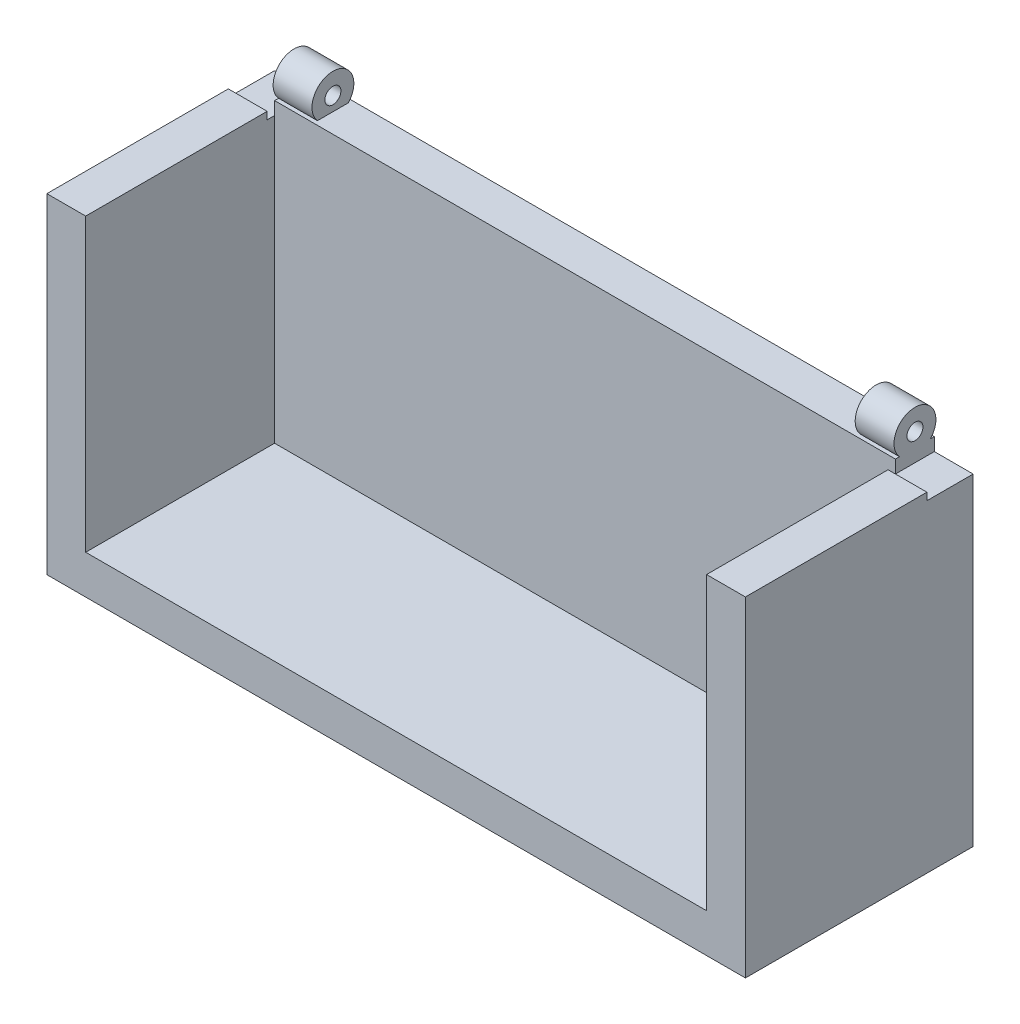
ISO-10303-21;
HEADER;
FILE_DESCRIPTION(('STEP AP214'),'2;1');
FILE_NAME('part.step','',(''),(''),'','','');
FILE_SCHEMA(('AUTOMOTIVE_DESIGN { 1 0 10303 214 1 1 1 1 }'));
ENDSEC;
DATA;
#1=APPLICATION_CONTEXT('core data for automotive mechanical design processes');
#2=APPLICATION_PROTOCOL_DEFINITION('international standard','automotive_design',2000,#1);
#3=PRODUCT_CONTEXT('',#1,'mechanical');
#4=PRODUCT('Part','Part','',(#3));
#5=PRODUCT_RELATED_PRODUCT_CATEGORY('part','',(#4));
#6=PRODUCT_DEFINITION_FORMATION('','',#4);
#7=PRODUCT_DEFINITION_CONTEXT('part definition',#1,'design');
#8=PRODUCT_DEFINITION('design','',#6,#7);
#9=PRODUCT_DEFINITION_SHAPE('','',#8);
#10=(LENGTH_UNIT() NAMED_UNIT(*) SI_UNIT(.MILLI.,.METRE.));
#11=(NAMED_UNIT(*) PLANE_ANGLE_UNIT() SI_UNIT($,.RADIAN.));
#12=(NAMED_UNIT(*) SI_UNIT($,.STERADIAN.) SOLID_ANGLE_UNIT());
#13=UNCERTAINTY_MEASURE_WITH_UNIT(LENGTH_MEASURE(1.E-05),#10,'distance_accuracy_value','');
#14=(GEOMETRIC_REPRESENTATION_CONTEXT(3) GLOBAL_UNCERTAINTY_ASSIGNED_CONTEXT((#13)) GLOBAL_UNIT_ASSIGNED_CONTEXT((#10,
#11,#12)) REPRESENTATION_CONTEXT('',''));
#15=CARTESIAN_POINT('',(0.,0.,0.));
#16=DIRECTION('',(0.,0.,1.));
#17=DIRECTION('',(1.,0.,0.));
#18=AXIS2_PLACEMENT_3D('',#15,#16,#17);
#19=CARTESIAN_POINT('',(0.,85.,0.));
#20=DIRECTION('',(0.,1.,0.));
#21=DIRECTION('',(0.,0.,1.));
#22=AXIS2_PLACEMENT_3D('',#19,#20,#21);
#23=PLANE('',#22);
#24=DIRECTION('',(0.,0.,-1.));
#25=VECTOR('',#24,1.);
#26=CARTESIAN_POINT('',(96.5915980230643,85.,4.40749588138387));
#27=LINE('',#26,#25);
#28=CARTESIAN_POINT('',(96.5915980230643,85.,-65.6823443186161));
#29=VERTEX_POINT('',#28);
#30=CARTESIAN_POINT('',(96.5915980230643,85.,-68.5425041186161));
#31=VERTEX_POINT('',#30);
#32=EDGE_CURVE('E238',#29,#31,#27,.T.);
#33=ORIENTED_EDGE('',*,*,#32,.F.);
#34=DIRECTION('',(-1.,0.,0.));
#35=VECTOR('',#34,1.);
#36=CARTESIAN_POINT('',(111.591598023064,85.,-65.6823443186161));
#37=LINE('',#36,#35);
#38=CARTESIAN_POINT('',(111.591598023064,85.,-65.6823443186161));
#39=VERTEX_POINT('',#38);
#40=EDGE_CURVE('E187',#39,#29,#37,.T.);
#41=ORIENTED_EDGE('',*,*,#40,.F.);
#42=DIRECTION('',(0.,0.,-1.));
#43=VECTOR('',#42,1.);
#44=CARTESIAN_POINT('',(111.591598023064,85.,-68.5425041186162));
#45=LINE('',#44,#43);
#46=CARTESIAN_POINT('',(111.591598023064,85.,-83.5425041186161));
#47=VERTEX_POINT('',#46);
#48=EDGE_CURVE('E268',#39,#47,#45,.T.);
#49=ORIENTED_EDGE('',*,*,#48,.T.);
#50=DIRECTION('',(-1.,0.,0.));
#51=VECTOR('',#50,1.);
#52=CARTESIAN_POINT('',(111.591598023064,85.,-83.5425041186161));
#53=LINE('',#52,#51);
#54=CARTESIAN_POINT('',(96.5915980230643,85.,-83.5425041186161));
#55=VERTEX_POINT('',#54);
#56=EDGE_CURVE('E271',#47,#55,#53,.T.);
#57=ORIENTED_EDGE('',*,*,#56,.T.);
#58=DIRECTION('',(0.,0.,1.));
#59=VECTOR('',#58,1.);
#60=CARTESIAN_POINT('',(96.5915980230643,85.,-83.5425041186161));
#61=LINE('',#60,#59);
#62=EDGE_CURVE('E265',#55,#31,#61,.T.);
#63=ORIENTED_EDGE('',*,*,#62,.T.);
#64=EDGE_LOOP('',(#33,#41,#49,#57,#63));
#65=FACE_BOUND('',#64,.T.);
#66=ADVANCED_FACE('F33',(#65),#23,.T.);
#67=CARTESIAN_POINT('',(111.591598023064,15.,58.9574958813839));
#68=DIRECTION('',(-1.,0.,0.));
#69=DIRECTION('',(0.,0.,1.));
#70=AXIS2_PLACEMENT_3D('',#67,#68,#69);
#71=PLANE('',#70);
#72=ORIENTED_EDGE('',*,*,#48,.F.);
#73=DIRECTION('',(0.,-1.,0.));
#74=VECTOR('',#73,1.);
#75=CARTESIAN_POINT('',(111.591598023064,87.85,-65.6823443186161));
#76=LINE('',#75,#74);
#77=CARTESIAN_POINT('',(111.591598023064,87.85,-65.6823443186161));
#78=VERTEX_POINT('',#77);
#79=EDGE_CURVE('E196',#78,#39,#76,.T.);
#80=ORIENTED_EDGE('',*,*,#79,.F.);
#81=DIRECTION('',(0.,0.,-1.));
#82=VECTOR('',#81,1.);
#83=CARTESIAN_POINT('',(111.591598023064,87.85,4.40749588138387));
#84=LINE('',#83,#82);
#85=CARTESIAN_POINT('',(111.591598023064,87.85,4.40749588138387));
#86=VERTEX_POINT('',#85);
#87=EDGE_CURVE('E193',#86,#78,#84,.T.);
#88=ORIENTED_EDGE('',*,*,#87,.F.);
#89=DIRECTION('',(0.,1.,0.));
#90=VECTOR('',#89,1.);
#91=CARTESIAN_POINT('',(111.591598023064,-39.6,4.40749588138387));
#92=LINE('',#91,#90);
#93=CARTESIAN_POINT('',(111.591598023064,-39.6,4.40749588138387));
#94=VERTEX_POINT('',#93);
#95=EDGE_CURVE('E172',#94,#86,#92,.T.);
#96=ORIENTED_EDGE('',*,*,#95,.F.);
#97=DIRECTION('',(0.,0.,1.));
#98=VECTOR('',#97,1.);
#99=CARTESIAN_POINT('',(111.591598023064,-39.6,-68.5425041186162));
#100=LINE('',#99,#98);
#101=CARTESIAN_POINT('',(111.591598023064,-39.6,-83.5425041186161));
#102=VERTEX_POINT('',#101);
#103=EDGE_CURVE('E247',#102,#94,#100,.T.);
#104=ORIENTED_EDGE('',*,*,#103,.F.);
#105=DIRECTION('',(0.,-1.,0.));
#106=VECTOR('',#105,1.);
#107=CARTESIAN_POINT('',(111.591598023064,15.,-83.5425041186161));
#108=LINE('',#107,#106);
#109=EDGE_CURVE('E311',#47,#102,#108,.T.);
#110=ORIENTED_EDGE('',*,*,#109,.F.);
#111=EDGE_LOOP('',(#72,#80,#88,#96,#104,#110));
#112=FACE_BOUND('',#111,.T.);
#113=ADVANCED_FACE('F35',(#112),#71,.F.);
#114=CARTESIAN_POINT('',(0.,90.,0.));
#115=DIRECTION('',(0.,1.,0.));
#116=DIRECTION('',(0.,0.,1.));
#117=AXIS2_PLACEMENT_3D('',#114,#115,#116);
#118=PLANE('',#117);
#119=DIRECTION('',(0.,0.,-1.));
#120=VECTOR('',#119,1.);
#121=CARTESIAN_POINT('',(-143.208401976936,90.,-83.5425041186162));
#122=LINE('',#121,#120);
#123=CARTESIAN_POINT('',(-143.208401976936,90.,-68.5425041186162));
#124=VERTEX_POINT('',#123);
#125=CARTESIAN_POINT('',(-143.208401976936,90.,-70.0970029147323));
#126=VERTEX_POINT('',#125);
#127=EDGE_CURVE('E252',#124,#126,#122,.T.);
#128=ORIENTED_EDGE('',*,*,#127,.F.);
#129=DIRECTION('',(1.,0.,0.));
#130=VECTOR('',#129,1.);
#131=CARTESIAN_POINT('',(-143.208401976936,90.,-68.5425041186162));
#132=LINE('',#131,#130);
#133=CARTESIAN_POINT('',(96.5915980230643,90.,-68.5425041186161));
#134=VERTEX_POINT('',#133);
#135=EDGE_CURVE('E301',#124,#134,#132,.T.);
#136=ORIENTED_EDGE('',*,*,#135,.T.);
#137=DIRECTION('',(0.,0.,1.));
#138=VECTOR('',#137,1.);
#139=CARTESIAN_POINT('',(96.5915980230643,90.,-83.5425041186161));
#140=LINE('',#139,#138);
#141=CARTESIAN_POINT('',(96.5915980230643,90.,-70.0970029147323));
#142=VERTEX_POINT('',#141);
#143=EDGE_CURVE('E249',#142,#134,#140,.T.);
#144=ORIENTED_EDGE('',*,*,#143,.F.);
#145=DIRECTION('',(1.,0.,0.));
#146=VECTOR('',#145,1.);
#147=CARTESIAN_POINT('',(81.5915980230643,90.,-70.0970029147323));
#148=LINE('',#147,#146);
#149=CARTESIAN_POINT('',(81.5915980230643,90.,-70.0970029147323));
#150=VERTEX_POINT('',#149);
#151=EDGE_CURVE('E41',#142,#150,#148,.F.);
#152=ORIENTED_EDGE('',*,*,#151,.T.);
#153=DIRECTION('',(0.,0.,1.));
#154=VECTOR('',#153,1.);
#155=CARTESIAN_POINT('',(81.5915980230643,90.,0.));
#156=LINE('',#155,#154);
#157=CARTESIAN_POINT('',(81.5915980230643,90.,-82.0449720805085));
#158=VERTEX_POINT('',#157);
#159=EDGE_CURVE('E11',#158,#150,#156,.T.);
#160=ORIENTED_EDGE('',*,*,#159,.F.);
#161=DIRECTION('',(1.,0.,0.));
#162=VECTOR('',#161,1.);
#163=CARTESIAN_POINT('',(81.5915980230643,90.,-82.0449720805085));
#164=LINE('',#163,#162);
#165=CARTESIAN_POINT('',(96.5915980230643,90.,-82.0449720805085));
#166=VERTEX_POINT('',#165);
#167=EDGE_CURVE('E321',#158,#166,#164,.T.);
#168=ORIENTED_EDGE('',*,*,#167,.T.);
#169=CARTESIAN_POINT('',(96.5915980230643,90.,-83.5425041186161));
#170=VERTEX_POINT('',#169);
#171=EDGE_CURVE('E269',#170,#166,#140,.T.);
#172=ORIENTED_EDGE('',*,*,#171,.F.);
#173=DIRECTION('',(-1.,0.,0.));
#174=VECTOR('',#173,1.);
#175=CARTESIAN_POINT('',(111.591598023064,90.,-83.5425041186161));
#176=LINE('',#175,#174);
#177=CARTESIAN_POINT('',(-143.208401976936,90.,-83.5425041186162));
#178=VERTEX_POINT('',#177);
#179=EDGE_CURVE('E306',#170,#178,#176,.T.);
#180=ORIENTED_EDGE('',*,*,#179,.T.);
#181=CARTESIAN_POINT('',(-143.208401976936,90.,-82.0449720805085));
#182=VERTEX_POINT('',#181);
#183=EDGE_CURVE('E259',#182,#178,#122,.T.);
#184=ORIENTED_EDGE('',*,*,#183,.F.);
#185=DIRECTION('',(-1.,0.,0.));
#186=VECTOR('',#185,1.);
#187=CARTESIAN_POINT('',(-128.208401976936,90.,-82.0449720805085));
#188=LINE('',#187,#186);
#189=CARTESIAN_POINT('',(-128.208401976936,90.,-82.0449720805085));
#190=VERTEX_POINT('',#189);
#191=EDGE_CURVE('E318',#182,#190,#188,.F.);
#192=ORIENTED_EDGE('',*,*,#191,.T.);
#193=DIRECTION('',(0.,0.,-1.));
#194=VECTOR('',#193,1.);
#195=CARTESIAN_POINT('',(-128.208401976936,90.,0.));
#196=LINE('',#195,#194);
#197=CARTESIAN_POINT('',(-128.208401976936,90.,-70.0970029147323));
#198=VERTEX_POINT('',#197);
#199=EDGE_CURVE('E316',#198,#190,#196,.T.);
#200=ORIENTED_EDGE('',*,*,#199,.F.);
#201=DIRECTION('',(-1.,0.,0.));
#202=VECTOR('',#201,1.);
#203=CARTESIAN_POINT('',(-128.208401976936,90.,-70.0970029147323));
#204=LINE('',#203,#202);
#205=EDGE_CURVE('E313',#198,#126,#204,.T.);
#206=ORIENTED_EDGE('',*,*,#205,.T.);
#207=EDGE_LOOP('',(#128,#136,#144,#152,#160,#168,#172,#180,#184,#192,#200,#206));
#208=FACE_BOUND('',#207,.T.);
#209=ADVANCED_FACE('F328',(#208),#118,.T.);
#210=CARTESIAN_POINT('',(-158.208401976936,15.,-83.5425041186162));
#211=DIRECTION('',(0.,0.,1.));
#212=DIRECTION('',(1.,0.,0.));
#213=AXIS2_PLACEMENT_3D('',#210,#211,#212);
#214=PLANE('',#213);
#215=DIRECTION('',(-1.,0.,0.));
#216=VECTOR('',#215,1.);
#217=CARTESIAN_POINT('',(-158.208401976936,85.,-83.5425041186162));
#218=LINE('',#217,#216);
#219=CARTESIAN_POINT('',(-143.208401976936,85.,-83.5425041186162));
#220=VERTEX_POINT('',#219);
#221=CARTESIAN_POINT('',(-158.208401976936,85.,-83.5425041186162));
#222=VERTEX_POINT('',#221);
#223=EDGE_CURVE('E255',#220,#222,#218,.T.);
#224=ORIENTED_EDGE('',*,*,#223,.F.);
#225=DIRECTION('',(0.,1.,0.));
#226=VECTOR('',#225,1.);
#227=CARTESIAN_POINT('',(-143.208401976936,85.,-83.5425041186162));
#228=LINE('',#227,#226);
#229=EDGE_CURVE('E260',#220,#178,#228,.T.);
#230=ORIENTED_EDGE('',*,*,#229,.T.);
#231=ORIENTED_EDGE('',*,*,#179,.F.);
#232=DIRECTION('',(0.,1.,0.));
#233=VECTOR('',#232,1.);
#234=CARTESIAN_POINT('',(96.5915980230643,85.,-83.5425041186161));
#235=LINE('',#234,#233);
#236=EDGE_CURVE('E276',#55,#170,#235,.T.);
#237=ORIENTED_EDGE('',*,*,#236,.F.);
#238=ORIENTED_EDGE('',*,*,#56,.F.);
#239=ORIENTED_EDGE('',*,*,#109,.T.);
#240=DIRECTION('',(1.,0.,0.));
#241=VECTOR('',#240,1.);
#242=CARTESIAN_POINT('',(111.591598023064,-39.6,-83.5425041186161));
#243=LINE('',#242,#241);
#244=CARTESIAN_POINT('',(-158.208401976936,-39.6,-83.5425041186162));
#245=VERTEX_POINT('',#244);
#246=EDGE_CURVE('E244',#245,#102,#243,.T.);
#247=ORIENTED_EDGE('',*,*,#246,.F.);
#248=DIRECTION('',(0.,-1.,0.));
#249=VECTOR('',#248,1.);
#250=CARTESIAN_POINT('',(-158.208401976936,15.,-83.5425041186162));
#251=LINE('',#250,#249);
#252=EDGE_CURVE('E309',#222,#245,#251,.T.);
#253=ORIENTED_EDGE('',*,*,#252,.F.);
#254=EDGE_LOOP('',(#224,#230,#231,#237,#238,#239,#247,#253));
#255=FACE_BOUND('',#254,.T.);
#256=ADVANCED_FACE('F447',(#255),#214,.F.);
#257=CARTESIAN_POINT('',(-158.208401976936,15.,58.9574958813839));
#258=DIRECTION('',(1.,0.,0.));
#259=DIRECTION('',(0.,0.,-1.));
#260=AXIS2_PLACEMENT_3D('',#257,#258,#259);
#261=PLANE('',#260);
#262=ORIENTED_EDGE('',*,*,#252,.T.);
#263=DIRECTION('',(0.,0.,-1.));
#264=VECTOR('',#263,1.);
#265=CARTESIAN_POINT('',(-158.208401976936,-39.6,-83.5425041186162));
#266=LINE('',#265,#264);
#267=CARTESIAN_POINT('',(-158.208401976936,-39.6,4.40749588138387));
#268=VERTEX_POINT('',#267);
#269=EDGE_CURVE('E237',#268,#245,#266,.T.);
#270=ORIENTED_EDGE('',*,*,#269,.F.);
#271=DIRECTION('',(0.,-1.,0.));
#272=VECTOR('',#271,1.);
#273=CARTESIAN_POINT('',(-158.208401976936,85.,4.40749588138387));
#274=LINE('',#273,#272);
#275=CARTESIAN_POINT('',(-158.208401976936,87.85,4.40749588138387));
#276=VERTEX_POINT('',#275);
#277=EDGE_CURVE('E225',#276,#268,#274,.T.);
#278=ORIENTED_EDGE('',*,*,#277,.F.);
#279=DIRECTION('',(0.,0.,1.));
#280=VECTOR('',#279,1.);
#281=CARTESIAN_POINT('',(-158.208401976936,87.85,-65.6823443676195));
#282=LINE('',#281,#280);
#283=CARTESIAN_POINT('',(-158.208401976936,87.85,-65.6823443676195));
#284=VERTEX_POINT('',#283);
#285=EDGE_CURVE('E207',#284,#276,#282,.T.);
#286=ORIENTED_EDGE('',*,*,#285,.F.);
#287=DIRECTION('',(0.,-1.,0.));
#288=VECTOR('',#287,1.);
#289=CARTESIAN_POINT('',(-158.208401976936,87.85,-65.6823443676195));
#290=LINE('',#289,#288);
#291=CARTESIAN_POINT('',(-158.208401976936,85.,-65.6823443676195));
#292=VERTEX_POINT('',#291);
#293=EDGE_CURVE('E210',#284,#292,#290,.T.);
#294=ORIENTED_EDGE('',*,*,#293,.T.);
#295=DIRECTION('',(0.,0.,1.));
#296=VECTOR('',#295,1.);
#297=CARTESIAN_POINT('',(-158.208401976936,85.,-68.5425041186162));
#298=LINE('',#297,#296);
#299=EDGE_CURVE('E48',#222,#292,#298,.T.);
#300=ORIENTED_EDGE('',*,*,#299,.F.);
#301=EDGE_LOOP('',(#262,#270,#278,#286,#294,#300));
#302=FACE_BOUND('',#301,.T.);
#303=ADVANCED_FACE('F438',(#302),#261,.F.);
#304=CARTESIAN_POINT('',(96.5915980230643,10.,-68.5425041186161));
#305=DIRECTION('',(0.,0.,-1.));
#306=DIRECTION('',(-1.,0.,0.));
#307=AXIS2_PLACEMENT_3D('',#304,#305,#306);
#308=PLANE('',#307);
#309=DIRECTION('',(0.,1.,0.));
#310=VECTOR('',#309,1.);
#311=CARTESIAN_POINT('',(-143.208401976936,85.,-68.5425041186162));
#312=LINE('',#311,#310);
#313=CARTESIAN_POINT('',(-143.208401976936,85.,-68.5425041186161));
#314=VERTEX_POINT('',#313);
#315=EDGE_CURVE('E257',#314,#124,#312,.T.);
#316=ORIENTED_EDGE('',*,*,#315,.F.);
#317=DIRECTION('',(0.,-1.,0.));
#318=VECTOR('',#317,1.);
#319=CARTESIAN_POINT('',(-143.208401976936,85.,-68.5425041186161));
#320=LINE('',#319,#318);
#321=CARTESIAN_POINT('',(-143.208401976936,-24.6,-68.5425041186161));
#322=VERTEX_POINT('',#321);
#323=EDGE_CURVE('E216',#314,#322,#320,.T.);
#324=ORIENTED_EDGE('',*,*,#323,.T.);
#325=DIRECTION('',(1.,0.,0.));
#326=VECTOR('',#325,1.);
#327=CARTESIAN_POINT('',(-143.208401976936,-24.6,-68.5425041186161));
#328=LINE('',#327,#326);
#329=CARTESIAN_POINT('',(96.5915980230643,-24.6,-68.5425041186161));
#330=VERTEX_POINT('',#329);
#331=EDGE_CURVE('E231',#322,#330,#328,.T.);
#332=ORIENTED_EDGE('',*,*,#331,.T.);
#333=DIRECTION('',(0.,-1.,0.));
#334=VECTOR('',#333,1.);
#335=CARTESIAN_POINT('',(96.5915980230643,85.,-68.5425041186161));
#336=LINE('',#335,#334);
#337=EDGE_CURVE('E220',#31,#330,#336,.T.);
#338=ORIENTED_EDGE('',*,*,#337,.F.);
#339=DIRECTION('',(0.,1.,0.));
#340=VECTOR('',#339,1.);
#341=CARTESIAN_POINT('',(96.5915980230643,85.,-68.5425041186161));
#342=LINE('',#341,#340);
#343=EDGE_CURVE('E274',#31,#134,#342,.T.);
#344=ORIENTED_EDGE('',*,*,#343,.T.);
#345=ORIENTED_EDGE('',*,*,#135,.F.);
#346=EDGE_LOOP('',(#316,#324,#332,#338,#344,#345));
#347=FACE_BOUND('',#346,.T.);
#348=ADVANCED_FACE('F433',(#347),#308,.F.);
#349=CARTESIAN_POINT('',(-128.208401976936,95.4538367899318,-76.0709874976204));
#350=DIRECTION('',(1.,0.,0.));
#351=DIRECTION('',(0.,0.,-1.));
#352=AXIS2_PLACEMENT_3D('',#349,#350,#351);
#353=PLANE('',#352);
#354=CARTESIAN_POINT('',(-128.208401976936,95.4538367899318,-76.0709874976204));
#355=DIRECTION('',(1.,0.,0.));
#356=DIRECTION('',(0.,0.,-1.));
#357=AXIS2_PLACEMENT_3D('',#354,#355,#356);
#358=CIRCLE('',#357,8.08905603440837);
#359=EDGE_CURVE('E298',#190,#198,#358,.T.);
#360=ORIENTED_EDGE('',*,*,#359,.T.);
#361=ORIENTED_EDGE('',*,*,#199,.T.);
#362=EDGE_LOOP('',(#360,#361));
#363=FACE_BOUND('',#362,.T.);
#364=CARTESIAN_POINT('',(-128.208401976936,95.4538367899318,-76.0709874976204));
#365=DIRECTION('',(1.,0.,0.));
#366=DIRECTION('',(0.,0.,-1.));
#367=AXIS2_PLACEMENT_3D('',#364,#365,#366);
#368=CIRCLE('',#367,3.08905603440837);
#369=CARTESIAN_POINT('',(-128.208401976936,95.4538367899318,-79.1600435320288));
#370=VERTEX_POINT('',#369);
#371=EDGE_CURVE('E292',#370,#370,#368,.T.);
#372=ORIENTED_EDGE('',*,*,#371,.F.);
#373=EDGE_LOOP('',(#372));
#374=FACE_BOUND('',#373,.T.);
#375=ADVANCED_FACE('F437',(#363,#374),#353,.T.);
#376=CARTESIAN_POINT('',(-143.208401976936,95.4538367899318,-76.0709874976204));
#377=DIRECTION('',(1.,0.,0.));
#378=DIRECTION('',(0.,0.,-1.));
#379=AXIS2_PLACEMENT_3D('',#376,#377,#378);
#380=PLANE('',#379);
#381=CARTESIAN_POINT('',(-143.208401976936,95.4538367899318,-76.0709874976204));
#382=DIRECTION('',(1.,0.,0.));
#383=DIRECTION('',(0.,0.,-1.));
#384=AXIS2_PLACEMENT_3D('',#381,#382,#383);
#385=CIRCLE('',#384,8.08905603440837);
#386=EDGE_CURVE('E295',#182,#126,#385,.T.);
#387=ORIENTED_EDGE('',*,*,#386,.F.);
#388=ORIENTED_EDGE('',*,*,#183,.T.);
#389=ORIENTED_EDGE('',*,*,#229,.F.);
#390=DIRECTION('',(0.,0.,-1.));
#391=VECTOR('',#390,1.);
#392=CARTESIAN_POINT('',(-143.208401976936,85.,-83.5425041186162));
#393=LINE('',#392,#391);
#394=EDGE_CURVE('E251',#314,#220,#393,.T.);
#395=ORIENTED_EDGE('',*,*,#394,.F.);
#396=ORIENTED_EDGE('',*,*,#315,.T.);
#397=ORIENTED_EDGE('',*,*,#127,.T.);
#398=EDGE_LOOP('',(#387,#388,#389,#395,#396,#397));
#399=FACE_BOUND('',#398,.T.);
#400=CARTESIAN_POINT('',(-143.208401976936,95.4538367899318,-76.0709874976204));
#401=DIRECTION('',(1.,0.,0.));
#402=DIRECTION('',(0.,0.,-1.));
#403=AXIS2_PLACEMENT_3D('',#400,#401,#402);
#404=CIRCLE('',#403,3.08905603440837);
#405=CARTESIAN_POINT('',(-143.208401976936,95.4538367899318,-79.1600435320288));
#406=VERTEX_POINT('',#405);
#407=EDGE_CURVE('E287',#406,#406,#404,.T.);
#408=ORIENTED_EDGE('',*,*,#407,.T.);
#409=EDGE_LOOP('',(#408));
#410=FACE_BOUND('',#409,.T.);
#411=ADVANCED_FACE('F549',(#399,#410),#380,.F.);
#412=CARTESIAN_POINT('',(-128.208401976936,95.4538367899318,-76.0709874976204));
#413=DIRECTION('',(-1.,0.,0.));
#414=DIRECTION('',(0.,0.,1.));
#415=AXIS2_PLACEMENT_3D('',#412,#413,#414);
#416=CYLINDRICAL_SURFACE('',#415,8.08905603440837);
#417=ORIENTED_EDGE('',*,*,#191,.F.);
#418=ORIENTED_EDGE('',*,*,#386,.T.);
#419=ORIENTED_EDGE('',*,*,#205,.F.);
#420=ORIENTED_EDGE('',*,*,#359,.F.);
#421=EDGE_LOOP('',(#417,#418,#419,#420));
#422=FACE_BOUND('',#421,.T.);
#423=ADVANCED_FACE('F554',(#422),#416,.T.);
#424=CARTESIAN_POINT('',(-128.208401976936,95.4538367899318,-76.0709874976204));
#425=DIRECTION('',(-1.,0.,0.));
#426=DIRECTION('',(0.,0.,1.));
#427=AXIS2_PLACEMENT_3D('',#424,#425,#426);
#428=CYLINDRICAL_SURFACE('',#427,3.08905603440837);
#429=ORIENTED_EDGE('',*,*,#371,.T.);
#430=EDGE_LOOP('',(#429));
#431=FACE_BOUND('',#430,.T.);
#432=ORIENTED_EDGE('',*,*,#407,.F.);
#433=EDGE_LOOP('',(#432));
#434=FACE_BOUND('',#433,.T.);
#435=ADVANCED_FACE('F595',(#431,#434),#428,.F.);
#436=CARTESIAN_POINT('',(81.5915980230643,95.4538367899318,-76.0709874976204));
#437=DIRECTION('',(1.,0.,0.));
#438=DIRECTION('',(0.,0.,-1.));
#439=AXIS2_PLACEMENT_3D('',#436,#437,#438);
#440=CYLINDRICAL_SURFACE('',#439,3.08905603440837);
#441=CARTESIAN_POINT('',(81.5915980230643,95.4538367899318,-76.0709874976204));
#442=DIRECTION('',(-1.,0.,0.));
#443=DIRECTION('',(0.,0.,1.));
#444=AXIS2_PLACEMENT_3D('',#441,#442,#443);
#445=CIRCLE('',#444,3.08905603440837);
#446=CARTESIAN_POINT('',(81.5915980230643,95.4538367899318,-72.981931463212));
#447=VERTEX_POINT('',#446);
#448=EDGE_CURVE('E280',#447,#447,#445,.T.);
#449=ORIENTED_EDGE('',*,*,#448,.T.);
#450=EDGE_LOOP('',(#449));
#451=FACE_BOUND('',#450,.T.);
#452=CARTESIAN_POINT('',(96.5915980230643,95.4538367899318,-76.0709874976204));
#453=DIRECTION('',(-1.,0.,0.));
#454=DIRECTION('',(0.,0.,1.));
#455=AXIS2_PLACEMENT_3D('',#452,#453,#454);
#456=CIRCLE('',#455,3.08905603440837);
#457=CARTESIAN_POINT('',(96.5915980230643,95.4538367899318,-72.981931463212));
#458=VERTEX_POINT('',#457);
#459=EDGE_CURVE('E263',#458,#458,#456,.T.);
#460=ORIENTED_EDGE('',*,*,#459,.F.);
#461=EDGE_LOOP('',(#460));
#462=FACE_BOUND('',#461,.T.);
#463=ADVANCED_FACE('F347',(#451,#462),#440,.F.);
#464=CARTESIAN_POINT('',(81.5915980230643,95.4538367899318,-76.0709874976204));
#465=DIRECTION('',(1.,0.,0.));
#466=DIRECTION('',(0.,0.,-1.));
#467=AXIS2_PLACEMENT_3D('',#464,#465,#466);
#468=CYLINDRICAL_SURFACE('',#467,8.08905603440837);
#469=ORIENTED_EDGE('',*,*,#151,.F.);
#470=CARTESIAN_POINT('',(96.5915980230643,95.4538367899318,-76.0709874976204));
#471=DIRECTION('',(-1.,0.,0.));
#472=DIRECTION('',(0.,0.,1.));
#473=AXIS2_PLACEMENT_3D('',#470,#471,#472);
#474=CIRCLE('',#473,8.08905603440837);
#475=EDGE_CURVE('E284',#142,#166,#474,.T.);
#476=ORIENTED_EDGE('',*,*,#475,.T.);
#477=ORIENTED_EDGE('',*,*,#167,.F.);
#478=CARTESIAN_POINT('',(81.5915980230643,95.4538367899318,-76.0709874976204));
#479=DIRECTION('',(-1.,0.,0.));
#480=DIRECTION('',(0.,0.,1.));
#481=AXIS2_PLACEMENT_3D('',#478,#479,#480);
#482=CIRCLE('',#481,8.08905603440837);
#483=EDGE_CURVE('E283',#150,#158,#482,.T.);
#484=ORIENTED_EDGE('',*,*,#483,.F.);
#485=EDGE_LOOP('',(#469,#476,#477,#484));
#486=FACE_BOUND('',#485,.T.);
#487=ADVANCED_FACE('F332',(#486),#468,.T.);
#488=CARTESIAN_POINT('',(81.5915980230643,0.,0.));
#489=DIRECTION('',(-1.,0.,0.));
#490=DIRECTION('',(0.,0.,1.));
#491=AXIS2_PLACEMENT_3D('',#488,#489,#490);
#492=PLANE('',#491);
#493=ORIENTED_EDGE('',*,*,#448,.F.);
#494=EDGE_LOOP('',(#493));
#495=FACE_BOUND('',#494,.T.);
#496=ORIENTED_EDGE('',*,*,#483,.T.);
#497=ORIENTED_EDGE('',*,*,#159,.T.);
#498=EDGE_LOOP('',(#496,#497));
#499=FACE_BOUND('',#498,.T.);
#500=ADVANCED_FACE('F334',(#495,#499),#492,.T.);
#501=CARTESIAN_POINT('',(96.5915980230643,0.,0.));
#502=DIRECTION('',(-1.,0.,0.));
#503=DIRECTION('',(0.,0.,1.));
#504=AXIS2_PLACEMENT_3D('',#501,#502,#503);
#505=PLANE('',#504);
#506=ORIENTED_EDGE('',*,*,#475,.F.);
#507=ORIENTED_EDGE('',*,*,#143,.T.);
#508=ORIENTED_EDGE('',*,*,#343,.F.);
#509=ORIENTED_EDGE('',*,*,#62,.F.);
#510=ORIENTED_EDGE('',*,*,#236,.T.);
#511=ORIENTED_EDGE('',*,*,#171,.T.);
#512=EDGE_LOOP('',(#506,#507,#508,#509,#510,#511));
#513=FACE_BOUND('',#512,.T.);
#514=ORIENTED_EDGE('',*,*,#459,.T.);
#515=EDGE_LOOP('',(#514));
#516=FACE_BOUND('',#515,.T.);
#517=ADVANCED_FACE('F336',(#513,#516),#505,.F.);
#518=CARTESIAN_POINT('',(0.,85.,0.));
#519=DIRECTION('',(0.,-1.,0.));
#520=DIRECTION('',(0.,0.,-1.));
#521=AXIS2_PLACEMENT_3D('',#518,#519,#520);
#522=PLANE('',#521);
#523=ORIENTED_EDGE('',*,*,#299,.T.);
#524=DIRECTION('',(1.,0.,0.));
#525=VECTOR('',#524,1.);
#526=CARTESIAN_POINT('',(-158.208401976936,85.,-65.6823443676195));
#527=LINE('',#526,#525);
#528=CARTESIAN_POINT('',(-143.208401976936,85.,-65.6823443676195));
#529=VERTEX_POINT('',#528);
#530=EDGE_CURVE('E53',#292,#529,#527,.T.);
#531=ORIENTED_EDGE('',*,*,#530,.T.);
#532=DIRECTION('',(0.,0.,-1.));
#533=VECTOR('',#532,1.);
#534=CARTESIAN_POINT('',(-143.208401976936,85.,4.40749588138387));
#535=LINE('',#534,#533);
#536=EDGE_CURVE('E235',#529,#314,#535,.T.);
#537=ORIENTED_EDGE('',*,*,#536,.T.);
#538=ORIENTED_EDGE('',*,*,#394,.T.);
#539=ORIENTED_EDGE('',*,*,#223,.T.);
#540=EDGE_LOOP('',(#523,#531,#537,#538,#539));
#541=FACE_BOUND('',#540,.T.);
#542=ADVANCED_FACE('F344',(#541),#522,.F.);
#543=CARTESIAN_POINT('',(0.,-39.6,0.));
#544=DIRECTION('',(0.,1.,0.));
#545=DIRECTION('',(0.,0.,1.));
#546=AXIS2_PLACEMENT_3D('',#543,#544,#545);
#547=PLANE('',#546);
#548=ORIENTED_EDGE('',*,*,#269,.T.);
#549=ORIENTED_EDGE('',*,*,#246,.T.);
#550=ORIENTED_EDGE('',*,*,#103,.T.);
#551=DIRECTION('',(1.,0.,0.));
#552=VECTOR('',#551,1.);
#553=CARTESIAN_POINT('',(-158.208401976936,-39.6,4.40749588138387));
#554=LINE('',#553,#552);
#555=EDGE_CURVE('E223',#268,#94,#554,.T.);
#556=ORIENTED_EDGE('',*,*,#555,.F.);
#557=EDGE_LOOP('',(#548,#549,#550,#556));
#558=FACE_BOUND('',#557,.T.);
#559=ADVANCED_FACE('F361',(#558),#547,.F.);
#560=CARTESIAN_POINT('',(-143.208401976936,85.,4.40749588138387));
#561=DIRECTION('',(1.,0.,0.));
#562=DIRECTION('',(0.,0.,-1.));
#563=AXIS2_PLACEMENT_3D('',#560,#561,#562);
#564=PLANE('',#563);
#565=ORIENTED_EDGE('',*,*,#323,.F.);
#566=ORIENTED_EDGE('',*,*,#536,.F.);
#567=DIRECTION('',(0.,-1.,0.));
#568=VECTOR('',#567,1.);
#569=CARTESIAN_POINT('',(-143.208401976936,87.85,-65.6823443676195));
#570=LINE('',#569,#568);
#571=CARTESIAN_POINT('',(-143.208401976936,87.85,-65.6823443676195));
#572=VERTEX_POINT('',#571);
#573=EDGE_CURVE('E213',#572,#529,#570,.T.);
#574=ORIENTED_EDGE('',*,*,#573,.F.);
#575=DIRECTION('',(0.,0.,-1.));
#576=VECTOR('',#575,1.);
#577=CARTESIAN_POINT('',(-143.208401976936,87.85,4.40749588138387));
#578=LINE('',#577,#576);
#579=CARTESIAN_POINT('',(-143.208401976936,87.85,4.40749588138387));
#580=VERTEX_POINT('',#579);
#581=EDGE_CURVE('E202',#580,#572,#578,.T.);
#582=ORIENTED_EDGE('',*,*,#581,.F.);
#583=DIRECTION('',(0.,-1.,0.));
#584=VECTOR('',#583,1.);
#585=CARTESIAN_POINT('',(-143.208401976936,85.,4.40749588138387));
#586=LINE('',#585,#584);
#587=CARTESIAN_POINT('',(-143.208401976936,-24.6,4.40749588138387));
#588=VERTEX_POINT('',#587);
#589=EDGE_CURVE('E217',#580,#588,#586,.T.);
#590=ORIENTED_EDGE('',*,*,#589,.T.);
#591=DIRECTION('',(0.,0.,-1.));
#592=VECTOR('',#591,1.);
#593=CARTESIAN_POINT('',(-143.208401976936,-24.6,4.40749588138387));
#594=LINE('',#593,#592);
#595=EDGE_CURVE('E228',#588,#322,#594,.T.);
#596=ORIENTED_EDGE('',*,*,#595,.T.);
#597=EDGE_LOOP('',(#565,#566,#574,#582,#590,#596));
#598=FACE_BOUND('',#597,.T.);
#599=ADVANCED_FACE('F364',(#598),#564,.T.);
#600=CARTESIAN_POINT('',(96.5915980230643,85.,4.40749588138387));
#601=DIRECTION('',(1.,0.,0.));
#602=DIRECTION('',(0.,0.,-1.));
#603=AXIS2_PLACEMENT_3D('',#600,#601,#602);
#604=PLANE('',#603);
#605=ORIENTED_EDGE('',*,*,#337,.T.);
#606=DIRECTION('',(0.,0.,-1.));
#607=VECTOR('',#606,1.);
#608=CARTESIAN_POINT('',(96.5915980230643,-24.6,4.40749588138387));
#609=LINE('',#608,#607);
#610=CARTESIAN_POINT('',(96.5915980230643,-24.6,4.40749588138387));
#611=VERTEX_POINT('',#610);
#612=EDGE_CURVE('E167',#611,#330,#609,.T.);
#613=ORIENTED_EDGE('',*,*,#612,.F.);
#614=DIRECTION('',(0.,-1.,0.));
#615=VECTOR('',#614,1.);
#616=CARTESIAN_POINT('',(96.5915980230643,85.,4.40749588138387));
#617=LINE('',#616,#615);
#618=CARTESIAN_POINT('',(96.5915980230643,87.85,4.40749588138387));
#619=VERTEX_POINT('',#618);
#620=EDGE_CURVE('E162',#619,#611,#617,.T.);
#621=ORIENTED_EDGE('',*,*,#620,.F.);
#622=DIRECTION('',(0.,0.,-1.));
#623=VECTOR('',#622,1.);
#624=CARTESIAN_POINT('',(96.5915980230643,87.85,4.40749588138387));
#625=LINE('',#624,#623);
#626=CARTESIAN_POINT('',(96.5915980230643,87.85,-65.6823443186161));
#627=VERTEX_POINT('',#626);
#628=EDGE_CURVE('E166',#619,#627,#625,.T.);
#629=ORIENTED_EDGE('',*,*,#628,.T.);
#630=DIRECTION('',(0.,-1.,0.));
#631=VECTOR('',#630,1.);
#632=CARTESIAN_POINT('',(96.5915980230643,87.85,-65.6823443186161));
#633=LINE('',#632,#631);
#634=EDGE_CURVE('E194',#627,#29,#633,.T.);
#635=ORIENTED_EDGE('',*,*,#634,.T.);
#636=ORIENTED_EDGE('',*,*,#32,.T.);
#637=EDGE_LOOP('',(#605,#613,#621,#629,#635,#636));
#638=FACE_BOUND('',#637,.T.);
#639=ADVANCED_FACE('F165',(#638),#604,.F.);
#640=CARTESIAN_POINT('',(-143.208401976936,-24.6,4.40749588138387));
#641=DIRECTION('',(0.,1.,0.));
#642=DIRECTION('',(0.,0.,1.));
#643=AXIS2_PLACEMENT_3D('',#640,#641,#642);
#644=PLANE('',#643);
#645=ORIENTED_EDGE('',*,*,#331,.F.);
#646=ORIENTED_EDGE('',*,*,#595,.F.);
#647=DIRECTION('',(1.,0.,0.));
#648=VECTOR('',#647,1.);
#649=CARTESIAN_POINT('',(-143.208401976936,-24.6,4.40749588138387));
#650=LINE('',#649,#648);
#651=EDGE_CURVE('E173',#588,#611,#650,.T.);
#652=ORIENTED_EDGE('',*,*,#651,.T.);
#653=ORIENTED_EDGE('',*,*,#612,.T.);
#654=EDGE_LOOP('',(#645,#646,#652,#653));
#655=FACE_BOUND('',#654,.T.);
#656=ADVANCED_FACE('F369',(#655),#644,.T.);
#657=CARTESIAN_POINT('',(0.,0.,4.40749588138387));
#658=DIRECTION('',(0.,0.,1.));
#659=DIRECTION('',(1.,0.,0.));
#660=AXIS2_PLACEMENT_3D('',#657,#658,#659);
#661=PLANE('',#660);
#662=ORIENTED_EDGE('',*,*,#589,.F.);
#663=DIRECTION('',(1.,0.,0.));
#664=VECTOR('',#663,1.);
#665=CARTESIAN_POINT('',(-158.208401976936,87.85,4.40749588138387));
#666=LINE('',#665,#664);
#667=EDGE_CURVE('E199',#276,#580,#666,.T.);
#668=ORIENTED_EDGE('',*,*,#667,.F.);
#669=ORIENTED_EDGE('',*,*,#277,.T.);
#670=ORIENTED_EDGE('',*,*,#555,.T.);
#671=ORIENTED_EDGE('',*,*,#95,.T.);
#672=DIRECTION('',(-1.,0.,0.));
#673=VECTOR('',#672,1.);
#674=CARTESIAN_POINT('',(111.591598023064,87.85,4.40749588138387));
#675=LINE('',#674,#673);
#676=EDGE_CURVE('E178',#86,#619,#675,.T.);
#677=ORIENTED_EDGE('',*,*,#676,.T.);
#678=ORIENTED_EDGE('',*,*,#620,.T.);
#679=ORIENTED_EDGE('',*,*,#651,.F.);
#680=EDGE_LOOP('',(#662,#668,#669,#670,#671,#677,#678,#679));
#681=FACE_BOUND('',#680,.T.);
#682=ADVANCED_FACE('F183',(#681),#661,.T.);
#683=CARTESIAN_POINT('',(-158.208401976936,87.85,-65.6823443676195));
#684=DIRECTION('',(0.,0.,-1.));
#685=DIRECTION('',(-1.,0.,0.));
#686=AXIS2_PLACEMENT_3D('',#683,#684,#685);
#687=PLANE('',#686);
#688=ORIENTED_EDGE('',*,*,#530,.F.);
#689=ORIENTED_EDGE('',*,*,#293,.F.);
#690=DIRECTION('',(1.,0.,0.));
#691=VECTOR('',#690,1.);
#692=CARTESIAN_POINT('',(-158.208401976936,87.85,-65.6823443676195));
#693=LINE('',#692,#691);
#694=EDGE_CURVE('E204',#284,#572,#693,.T.);
#695=ORIENTED_EDGE('',*,*,#694,.T.);
#696=ORIENTED_EDGE('',*,*,#573,.T.);
#697=EDGE_LOOP('',(#688,#689,#695,#696));
#698=FACE_BOUND('',#697,.T.);
#699=ADVANCED_FACE('F377',(#698),#687,.T.);
#700=CARTESIAN_POINT('',(0.,87.85,0.));
#701=DIRECTION('',(0.,1.,0.));
#702=DIRECTION('',(0.,0.,1.));
#703=AXIS2_PLACEMENT_3D('',#700,#701,#702);
#704=PLANE('',#703);
#705=ORIENTED_EDGE('',*,*,#667,.T.);
#706=ORIENTED_EDGE('',*,*,#581,.T.);
#707=ORIENTED_EDGE('',*,*,#694,.F.);
#708=ORIENTED_EDGE('',*,*,#285,.T.);
#709=EDGE_LOOP('',(#705,#706,#707,#708));
#710=FACE_BOUND('',#709,.T.);
#711=ADVANCED_FACE('F380',(#710),#704,.T.);
#712=CARTESIAN_POINT('',(111.591598023064,87.85,-65.6823443186161));
#713=DIRECTION('',(0.,0.,1.));
#714=DIRECTION('',(1.,0.,0.));
#715=AXIS2_PLACEMENT_3D('',#712,#713,#714);
#716=PLANE('',#715);
#717=ORIENTED_EDGE('',*,*,#40,.T.);
#718=ORIENTED_EDGE('',*,*,#634,.F.);
#719=DIRECTION('',(-1.,0.,0.));
#720=VECTOR('',#719,1.);
#721=CARTESIAN_POINT('',(111.591598023064,87.85,-65.6823443186161));
#722=LINE('',#721,#720);
#723=EDGE_CURVE('E180',#78,#627,#722,.T.);
#724=ORIENTED_EDGE('',*,*,#723,.F.);
#725=ORIENTED_EDGE('',*,*,#79,.T.);
#726=EDGE_LOOP('',(#717,#718,#724,#725));
#727=FACE_BOUND('',#726,.T.);
#728=ADVANCED_FACE('F384',(#727),#716,.F.);
#729=CARTESIAN_POINT('',(0.,87.85,0.));
#730=DIRECTION('',(0.,-1.,0.));
#731=DIRECTION('',(0.,0.,-1.));
#732=AXIS2_PLACEMENT_3D('',#729,#730,#731);
#733=PLANE('',#732);
#734=ORIENTED_EDGE('',*,*,#676,.F.);
#735=ORIENTED_EDGE('',*,*,#87,.T.);
#736=ORIENTED_EDGE('',*,*,#723,.T.);
#737=ORIENTED_EDGE('',*,*,#628,.F.);
#738=EDGE_LOOP('',(#734,#735,#736,#737));
#739=FACE_BOUND('',#738,.T.);
#740=ADVANCED_FACE('F177',(#739),#733,.F.);
#741=CLOSED_SHELL('',(#66,#113,#209,#256,#303,#348,#375,#411,#423,#435,#463,#487,#500,#517,#542,
#559,#599,#639,#656,#682,#699,#711,#728,#740));
#742=MANIFOLD_SOLID_BREP('B2',#741);
#743=ADVANCED_BREP_SHAPE_REPRESENTATION('',(#18,#742),#14);
#744=SHAPE_DEFINITION_REPRESENTATION(#9,#743);
ENDSEC;
END-ISO-10303-21;
